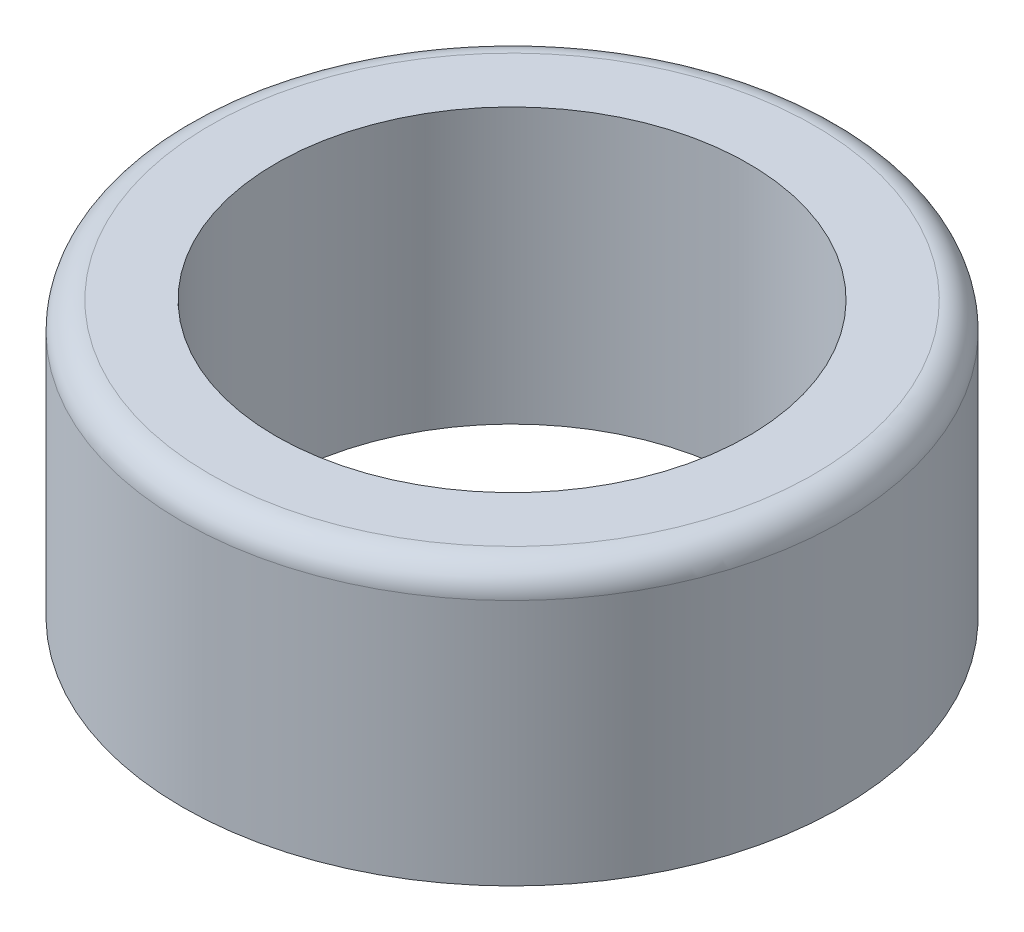
ISO-10303-21;
HEADER;
FILE_DESCRIPTION(('STEP AP214'),'2;1');
FILE_NAME('part.step','',(''),(''),'','','');
FILE_SCHEMA(('AUTOMOTIVE_DESIGN { 1 0 10303 214 1 1 1 1 }'));
ENDSEC;
DATA;
#1=APPLICATION_CONTEXT('core data for automotive mechanical design processes');
#2=APPLICATION_PROTOCOL_DEFINITION('international standard','automotive_design',2000,#1);
#3=PRODUCT_CONTEXT('',#1,'mechanical');
#4=PRODUCT('Part','Part','',(#3));
#5=PRODUCT_RELATED_PRODUCT_CATEGORY('part','',(#4));
#6=PRODUCT_DEFINITION_FORMATION('','',#4);
#7=PRODUCT_DEFINITION_CONTEXT('part definition',#1,'design');
#8=PRODUCT_DEFINITION('design','',#6,#7);
#9=PRODUCT_DEFINITION_SHAPE('','',#8);
#10=(LENGTH_UNIT() NAMED_UNIT(*) SI_UNIT(.MILLI.,.METRE.));
#11=(NAMED_UNIT(*) PLANE_ANGLE_UNIT() SI_UNIT($,.RADIAN.));
#12=(NAMED_UNIT(*) SI_UNIT($,.STERADIAN.) SOLID_ANGLE_UNIT());
#13=UNCERTAINTY_MEASURE_WITH_UNIT(LENGTH_MEASURE(1.E-05),#10,'distance_accuracy_value','');
#14=(GEOMETRIC_REPRESENTATION_CONTEXT(3) GLOBAL_UNCERTAINTY_ASSIGNED_CONTEXT((#13)) GLOBAL_UNIT_ASSIGNED_CONTEXT((#10,
#11,#12)) REPRESENTATION_CONTEXT('',''));
#15=CARTESIAN_POINT('',(0.,0.,0.));
#16=DIRECTION('',(0.,0.,1.));
#17=DIRECTION('',(1.,0.,0.));
#18=AXIS2_PLACEMENT_3D('',#15,#16,#17);
#19=CARTESIAN_POINT('',(0.,10.,0.));
#20=DIRECTION('',(0.,-1.,0.));
#21=DIRECTION('',(0.,0.,-1.));
#22=AXIS2_PLACEMENT_3D('',#19,#20,#21);
#23=CYLINDRICAL_SURFACE('',#22,12.);
#24=CARTESIAN_POINT('',(0.,9.,0.));
#25=DIRECTION('',(0.,1.,0.));
#26=DIRECTION('',(0.,0.,1.));
#27=AXIS2_PLACEMENT_3D('',#24,#25,#26);
#28=CIRCLE('',#27,12.);
#29=CARTESIAN_POINT('',(0.,9.,12.));
#30=VERTEX_POINT('',#29);
#31=EDGE_CURVE('E10',#30,#30,#28,.F.);
#32=ORIENTED_EDGE('',*,*,#31,.T.);
#33=EDGE_LOOP('',(#32));
#34=FACE_BOUND('',#33,.T.);
#35=CARTESIAN_POINT('',(0.,0.,0.));
#36=DIRECTION('',(0.,1.,0.));
#37=DIRECTION('',(0.,0.,1.));
#38=AXIS2_PLACEMENT_3D('',#35,#36,#37);
#39=CIRCLE('',#38,12.);
#40=CARTESIAN_POINT('',(0.,0.,12.));
#41=VERTEX_POINT('',#40);
#42=EDGE_CURVE('E55',#41,#41,#39,.T.);
#43=ORIENTED_EDGE('',*,*,#42,.T.);
#44=EDGE_LOOP('',(#43));
#45=FACE_BOUND('',#44,.T.);
#46=ADVANCED_FACE('F35',(#34,#45),#23,.T.);
#47=CARTESIAN_POINT('',(0.,10.,0.));
#48=DIRECTION('',(0.,-1.,0.));
#49=DIRECTION('',(0.,0.,-1.));
#50=AXIS2_PLACEMENT_3D('',#47,#48,#49);
#51=CYLINDRICAL_SURFACE('',#50,8.6);
#52=CARTESIAN_POINT('',(0.,10.,0.));
#53=DIRECTION('',(0.,1.,0.));
#54=DIRECTION('',(0.,0.,1.));
#55=AXIS2_PLACEMENT_3D('',#52,#53,#54);
#56=CIRCLE('',#55,8.6);
#57=CARTESIAN_POINT('',(0.,10.,8.6));
#58=VERTEX_POINT('',#57);
#59=EDGE_CURVE('E46',#58,#58,#56,.T.);
#60=ORIENTED_EDGE('',*,*,#59,.T.);
#61=EDGE_LOOP('',(#60));
#62=FACE_BOUND('',#61,.T.);
#63=CARTESIAN_POINT('',(0.,0.,0.));
#64=DIRECTION('',(0.,1.,0.));
#65=DIRECTION('',(0.,0.,1.));
#66=AXIS2_PLACEMENT_3D('',#63,#64,#65);
#67=CIRCLE('',#66,8.6);
#68=CARTESIAN_POINT('',(0.,0.,8.6));
#69=VERTEX_POINT('',#68);
#70=EDGE_CURVE('E50',#69,#69,#67,.T.);
#71=ORIENTED_EDGE('',*,*,#70,.F.);
#72=EDGE_LOOP('',(#71));
#73=FACE_BOUND('',#72,.T.);
#74=ADVANCED_FACE('F67',(#62,#73),#51,.F.);
#75=CARTESIAN_POINT('',(0.,10.,0.));
#76=DIRECTION('',(0.,1.,0.));
#77=DIRECTION('',(0.,0.,1.));
#78=AXIS2_PLACEMENT_3D('',#75,#76,#77);
#79=PLANE('',#78);
#80=CARTESIAN_POINT('',(0.,10.,0.));
#81=DIRECTION('',(0.,1.,0.));
#82=DIRECTION('',(0.,0.,1.));
#83=AXIS2_PLACEMENT_3D('',#80,#81,#82);
#84=CIRCLE('',#83,11.);
#85=CARTESIAN_POINT('',(0.,10.,11.));
#86=VERTEX_POINT('',#85);
#87=EDGE_CURVE('E42',#86,#86,#84,.T.);
#88=ORIENTED_EDGE('',*,*,#87,.T.);
#89=EDGE_LOOP('',(#88));
#90=FACE_BOUND('',#89,.T.);
#91=ORIENTED_EDGE('',*,*,#59,.F.);
#92=EDGE_LOOP('',(#91));
#93=FACE_BOUND('',#92,.T.);
#94=ADVANCED_FACE('F63',(#90,#93),#79,.T.);
#95=CARTESIAN_POINT('',(0.,0.,0.));
#96=DIRECTION('',(0.,1.,0.));
#97=DIRECTION('',(0.,0.,1.));
#98=AXIS2_PLACEMENT_3D('',#95,#96,#97);
#99=PLANE('',#98);
#100=ORIENTED_EDGE('',*,*,#42,.F.);
#101=EDGE_LOOP('',(#100));
#102=FACE_BOUND('',#101,.T.);
#103=ORIENTED_EDGE('',*,*,#70,.T.);
#104=EDGE_LOOP('',(#103));
#105=FACE_BOUND('',#104,.T.);
#106=ADVANCED_FACE('F60',(#102,#105),#99,.F.);
#107=CARTESIAN_POINT('',(0.,9.,0.));
#108=DIRECTION('',(0.,1.,0.));
#109=DIRECTION('',(0.,0.,1.));
#110=AXIS2_PLACEMENT_3D('',#107,#108,#109);
#111=TOROIDAL_SURFACE('',#110,11.,1.);
#112=ORIENTED_EDGE('',*,*,#31,.F.);
#113=EDGE_LOOP('',(#112));
#114=FACE_BOUND('',#113,.T.);
#115=ORIENTED_EDGE('',*,*,#87,.F.);
#116=EDGE_LOOP('',(#115));
#117=FACE_BOUND('',#116,.T.);
#118=ADVANCED_FACE('F37',(#114,#117),#111,.T.);
#119=CLOSED_SHELL('',(#46,#74,#94,#106,#118));
#120=MANIFOLD_SOLID_BREP('B2',#119);
#121=ADVANCED_BREP_SHAPE_REPRESENTATION('',(#18,#120),#14);
#122=SHAPE_DEFINITION_REPRESENTATION(#9,#121);
ENDSEC;
END-ISO-10303-21;
